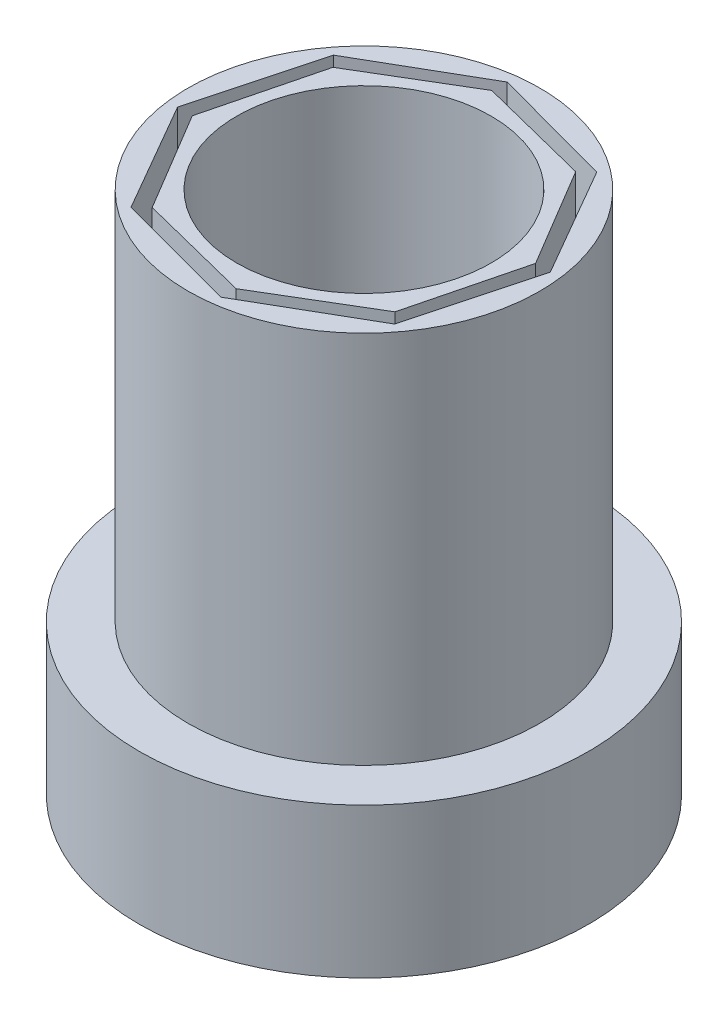
ISO-10303-21;
HEADER;
FILE_DESCRIPTION(('STEP AP214'),'2;1');
FILE_NAME('part.step','',(''),(''),'','','');
FILE_SCHEMA(('AUTOMOTIVE_DESIGN { 1 0 10303 214 1 1 1 1 }'));
ENDSEC;
DATA;
#1=APPLICATION_CONTEXT('core data for automotive mechanical design processes');
#2=APPLICATION_PROTOCOL_DEFINITION('international standard','automotive_design',2000,#1);
#3=PRODUCT_CONTEXT('',#1,'mechanical');
#4=PRODUCT('Part','Part','',(#3));
#5=PRODUCT_RELATED_PRODUCT_CATEGORY('part','',(#4));
#6=PRODUCT_DEFINITION_FORMATION('','',#4);
#7=PRODUCT_DEFINITION_CONTEXT('part definition',#1,'design');
#8=PRODUCT_DEFINITION('design','',#6,#7);
#9=PRODUCT_DEFINITION_SHAPE('','',#8);
#10=(LENGTH_UNIT() NAMED_UNIT(*) SI_UNIT(.MILLI.,.METRE.));
#11=(NAMED_UNIT(*) PLANE_ANGLE_UNIT() SI_UNIT($,.RADIAN.));
#12=(NAMED_UNIT(*) SI_UNIT($,.STERADIAN.) SOLID_ANGLE_UNIT());
#13=UNCERTAINTY_MEASURE_WITH_UNIT(LENGTH_MEASURE(1.E-05),#10,'distance_accuracy_value','');
#14=(GEOMETRIC_REPRESENTATION_CONTEXT(3) GLOBAL_UNCERTAINTY_ASSIGNED_CONTEXT((#13)) GLOBAL_UNIT_ASSIGNED_CONTEXT((#10,
#11,#12)) REPRESENTATION_CONTEXT('',''));
#15=CARTESIAN_POINT('',(0.,0.,0.));
#16=DIRECTION('',(0.,0.,1.));
#17=DIRECTION('',(1.,0.,0.));
#18=AXIS2_PLACEMENT_3D('',#15,#16,#17);
#19=CARTESIAN_POINT('',(0.,50.,0.));
#20=DIRECTION('',(0.,1.,0.));
#21=DIRECTION('',(0.,0.,1.));
#22=AXIS2_PLACEMENT_3D('',#19,#20,#21);
#23=PLANE('',#22);
#24=DIRECTION('',(0.858677824366591,0.,-0.512515749944388));
#25=VECTOR('',#24,1.);
#26=CARTESIAN_POINT('',(2.92893218813454,50.,20.));
#27=LINE('',#26,#25);
#28=CARTESIAN_POINT('',(2.92893218813454,50.,20.));
#29=VERTEX_POINT('',#28);
#30=CARTESIAN_POINT('',(16.2132034355964,50.,12.0710678118654));
#31=VERTEX_POINT('',#30);
#32=EDGE_CURVE('E266',#29,#31,#27,.T.);
#33=ORIENTED_EDGE('',*,*,#32,.T.);
#34=DIRECTION('',(0.244773550213542,0.,-0.969580274714713));
#35=VECTOR('',#34,1.);
#36=CARTESIAN_POINT('',(16.2132034355964,50.,12.0710678118654));
#37=LINE('',#36,#35);
#38=CARTESIAN_POINT('',(20.,50.,-2.92893218813454));
#39=VERTEX_POINT('',#38);
#40=EDGE_CURVE('E270',#31,#39,#37,.T.);
#41=ORIENTED_EDGE('',*,*,#40,.T.);
#42=DIRECTION('',(-0.512515749944388,0.,-0.858677824366591));
#43=VECTOR('',#42,1.);
#44=CARTESIAN_POINT('',(20.,50.,-2.92893218813454));
#45=LINE('',#44,#43);
#46=CARTESIAN_POINT('',(12.0710678118655,50.,-16.2132034355964));
#47=VERTEX_POINT('',#46);
#48=EDGE_CURVE('E274',#39,#47,#45,.T.);
#49=ORIENTED_EDGE('',*,*,#48,.T.);
#50=DIRECTION('',(-0.969580274714713,0.,-0.244773550213542));
#51=VECTOR('',#50,1.);
#52=CARTESIAN_POINT('',(12.0710678118655,50.,-16.2132034355964));
#53=LINE('',#52,#51);
#54=CARTESIAN_POINT('',(-2.92893218813455,50.,-20.));
#55=VERTEX_POINT('',#54);
#56=EDGE_CURVE('E277',#47,#55,#53,.T.);
#57=ORIENTED_EDGE('',*,*,#56,.T.);
#58=DIRECTION('',(-0.858677824366591,0.,0.512515749944388));
#59=VECTOR('',#58,1.);
#60=CARTESIAN_POINT('',(-2.92893218813455,50.,-20.));
#61=LINE('',#60,#59);
#62=CARTESIAN_POINT('',(-16.2132034355964,50.,-12.0710678118654));
#63=VERTEX_POINT('',#62);
#64=EDGE_CURVE('E280',#55,#63,#61,.T.);
#65=ORIENTED_EDGE('',*,*,#64,.T.);
#66=DIRECTION('',(-0.244773550213542,0.,0.969580274714713));
#67=VECTOR('',#66,1.);
#68=CARTESIAN_POINT('',(-16.2132034355964,50.,-12.0710678118654));
#69=LINE('',#68,#67);
#70=CARTESIAN_POINT('',(-20.,50.,2.92893218813455));
#71=VERTEX_POINT('',#70);
#72=EDGE_CURVE('E283',#63,#71,#69,.T.);
#73=ORIENTED_EDGE('',*,*,#72,.T.);
#74=DIRECTION('',(0.512515749944388,0.,0.858677824366591));
#75=VECTOR('',#74,1.);
#76=CARTESIAN_POINT('',(-20.,50.,2.92893218813455));
#77=LINE('',#76,#75);
#78=CARTESIAN_POINT('',(-12.0710678118655,50.,16.2132034355964));
#79=VERTEX_POINT('',#78);
#80=EDGE_CURVE('E286',#71,#79,#77,.T.);
#81=ORIENTED_EDGE('',*,*,#80,.T.);
#82=DIRECTION('',(0.969580274714713,0.,0.244773550213542));
#83=VECTOR('',#82,1.);
#84=CARTESIAN_POINT('',(-12.0710678118655,50.,16.2132034355964));
#85=LINE('',#84,#83);
#86=EDGE_CURVE('E289',#79,#29,#85,.T.);
#87=ORIENTED_EDGE('',*,*,#86,.T.);
#88=EDGE_LOOP('',(#33,#41,#49,#57,#65,#73,#81,#87));
#89=FACE_BOUND('',#88,.T.);
#90=CARTESIAN_POINT('',(0.,50.,0.));
#91=DIRECTION('',(0.,1.,0.));
#92=DIRECTION('',(0.,0.,1.));
#93=AXIS2_PLACEMENT_3D('',#90,#91,#92);
#94=CIRCLE('',#93,17.);
#95=CARTESIAN_POINT('',(0.,50.,17.));
#96=VERTEX_POINT('',#95);
#97=EDGE_CURVE('E258',#96,#96,#94,.T.);
#98=ORIENTED_EDGE('',*,*,#97,.F.);
#99=EDGE_LOOP('',(#98));
#100=FACE_BOUND('',#99,.T.);
#101=ADVANCED_FACE('F39',(#89,#100),#23,.T.);
#102=CARTESIAN_POINT('',(2.92893218813454,50.,20.));
#103=DIRECTION('',(-0.512515749944388,0.,-0.858677824366591));
#104=DIRECTION('',(-0.858677824366591,0.,0.512515749944388));
#105=AXIS2_PLACEMENT_3D('',#102,#103,#104);
#106=PLANE('',#105);
#107=DIRECTION('',(0.858677824366591,0.,-0.512515749944388));
#108=VECTOR('',#107,1.);
#109=CARTESIAN_POINT('',(2.92893218813454,0.,20.));
#110=LINE('',#109,#108);
#111=CARTESIAN_POINT('',(2.92893218813454,0.,20.));
#112=VERTEX_POINT('',#111);
#113=CARTESIAN_POINT('',(16.2132034355964,0.,12.0710678118654));
#114=VERTEX_POINT('',#113);
#115=EDGE_CURVE('E262',#112,#114,#110,.T.);
#116=ORIENTED_EDGE('',*,*,#115,.T.);
#117=DIRECTION('',(0.,-1.,0.));
#118=VECTOR('',#117,1.);
#119=CARTESIAN_POINT('',(16.2132034355964,50.,12.0710678118654));
#120=LINE('',#119,#118);
#121=EDGE_CURVE('E11',#31,#114,#120,.T.);
#122=ORIENTED_EDGE('',*,*,#121,.F.);
#123=ORIENTED_EDGE('',*,*,#32,.F.);
#124=DIRECTION('',(0.,-1.,0.));
#125=VECTOR('',#124,1.);
#126=CARTESIAN_POINT('',(2.92893218813454,50.,20.));
#127=LINE('',#126,#125);
#128=EDGE_CURVE('E292',#29,#112,#127,.T.);
#129=ORIENTED_EDGE('',*,*,#128,.T.);
#130=EDGE_LOOP('',(#116,#122,#123,#129));
#131=FACE_BOUND('',#130,.T.);
#132=ADVANCED_FACE('F41',(#131),#106,.F.);
#133=CARTESIAN_POINT('',(16.2132034355964,50.,12.0710678118654));
#134=DIRECTION('',(-0.969580274714713,0.,-0.244773550213542));
#135=DIRECTION('',(-0.244773550213542,0.,0.969580274714713));
#136=AXIS2_PLACEMENT_3D('',#133,#134,#135);
#137=PLANE('',#136);
#138=DIRECTION('',(0.244773550213542,0.,-0.969580274714713));
#139=VECTOR('',#138,1.);
#140=CARTESIAN_POINT('',(16.2132034355964,0.,12.0710678118654));
#141=LINE('',#140,#139);
#142=CARTESIAN_POINT('',(20.,0.,-2.92893218813454));
#143=VERTEX_POINT('',#142);
#144=EDGE_CURVE('E296',#114,#143,#141,.T.);
#145=ORIENTED_EDGE('',*,*,#144,.T.);
#146=DIRECTION('',(0.,-1.,0.));
#147=VECTOR('',#146,1.);
#148=CARTESIAN_POINT('',(20.,50.,-2.92893218813454));
#149=LINE('',#148,#147);
#150=EDGE_CURVE('E48',#39,#143,#149,.T.);
#151=ORIENTED_EDGE('',*,*,#150,.F.);
#152=ORIENTED_EDGE('',*,*,#40,.F.);
#153=ORIENTED_EDGE('',*,*,#121,.T.);
#154=EDGE_LOOP('',(#145,#151,#152,#153));
#155=FACE_BOUND('',#154,.T.);
#156=ADVANCED_FACE('F353',(#155),#137,.F.);
#157=CARTESIAN_POINT('',(20.,50.,-2.92893218813454));
#158=DIRECTION('',(-0.858677824366591,0.,0.512515749944388));
#159=DIRECTION('',(0.512515749944388,0.,0.858677824366591));
#160=AXIS2_PLACEMENT_3D('',#157,#158,#159);
#161=PLANE('',#160);
#162=DIRECTION('',(-0.512515749944388,0.,-0.858677824366591));
#163=VECTOR('',#162,1.);
#164=CARTESIAN_POINT('',(20.,0.,-2.92893218813454));
#165=LINE('',#164,#163);
#166=CARTESIAN_POINT('',(12.0710678118655,0.,-16.2132034355964));
#167=VERTEX_POINT('',#166);
#168=EDGE_CURVE('E300',#143,#167,#165,.T.);
#169=ORIENTED_EDGE('',*,*,#168,.T.);
#170=DIRECTION('',(0.,-1.,0.));
#171=VECTOR('',#170,1.);
#172=CARTESIAN_POINT('',(12.0710678118655,50.,-16.2132034355964));
#173=LINE('',#172,#171);
#174=EDGE_CURVE('E342',#47,#167,#173,.T.);
#175=ORIENTED_EDGE('',*,*,#174,.F.);
#176=ORIENTED_EDGE('',*,*,#48,.F.);
#177=ORIENTED_EDGE('',*,*,#150,.T.);
#178=EDGE_LOOP('',(#169,#175,#176,#177));
#179=FACE_BOUND('',#178,.T.);
#180=ADVANCED_FACE('F350',(#179),#161,.F.);
#181=CARTESIAN_POINT('',(12.0710678118655,50.,-16.2132034355964));
#182=DIRECTION('',(-0.244773550213542,0.,0.969580274714713));
#183=DIRECTION('',(0.969580274714713,0.,0.244773550213542));
#184=AXIS2_PLACEMENT_3D('',#181,#182,#183);
#185=PLANE('',#184);
#186=DIRECTION('',(-0.969580274714713,0.,-0.244773550213542));
#187=VECTOR('',#186,1.);
#188=CARTESIAN_POINT('',(12.0710678118655,0.,-16.2132034355964));
#189=LINE('',#188,#187);
#190=CARTESIAN_POINT('',(-2.92893218813455,0.,-20.));
#191=VERTEX_POINT('',#190);
#192=EDGE_CURVE('E304',#167,#191,#189,.T.);
#193=ORIENTED_EDGE('',*,*,#192,.T.);
#194=DIRECTION('',(0.,-1.,0.));
#195=VECTOR('',#194,1.);
#196=CARTESIAN_POINT('',(-2.92893218813455,50.,-20.));
#197=LINE('',#196,#195);
#198=EDGE_CURVE('E338',#55,#191,#197,.T.);
#199=ORIENTED_EDGE('',*,*,#198,.F.);
#200=ORIENTED_EDGE('',*,*,#56,.F.);
#201=ORIENTED_EDGE('',*,*,#174,.T.);
#202=EDGE_LOOP('',(#193,#199,#200,#201));
#203=FACE_BOUND('',#202,.T.);
#204=ADVANCED_FACE('F359',(#203),#185,.F.);
#205=CARTESIAN_POINT('',(-2.92893218813455,50.,-20.));
#206=DIRECTION('',(0.512515749944388,0.,0.858677824366591));
#207=DIRECTION('',(0.858677824366591,0.,-0.512515749944388));
#208=AXIS2_PLACEMENT_3D('',#205,#206,#207);
#209=PLANE('',#208);
#210=DIRECTION('',(-0.858677824366591,0.,0.512515749944388));
#211=VECTOR('',#210,1.);
#212=CARTESIAN_POINT('',(-2.92893218813455,0.,-20.));
#213=LINE('',#212,#211);
#214=CARTESIAN_POINT('',(-16.2132034355964,0.,-12.0710678118654));
#215=VERTEX_POINT('',#214);
#216=EDGE_CURVE('E308',#191,#215,#213,.T.);
#217=ORIENTED_EDGE('',*,*,#216,.T.);
#218=DIRECTION('',(0.,-1.,0.));
#219=VECTOR('',#218,1.);
#220=CARTESIAN_POINT('',(-16.2132034355964,50.,-12.0710678118654));
#221=LINE('',#220,#219);
#222=EDGE_CURVE('E334',#63,#215,#221,.T.);
#223=ORIENTED_EDGE('',*,*,#222,.F.);
#224=ORIENTED_EDGE('',*,*,#64,.F.);
#225=ORIENTED_EDGE('',*,*,#198,.T.);
#226=EDGE_LOOP('',(#217,#223,#224,#225));
#227=FACE_BOUND('',#226,.T.);
#228=ADVANCED_FACE('F363',(#227),#209,.F.);
#229=CARTESIAN_POINT('',(-16.2132034355964,50.,-12.0710678118654));
#230=DIRECTION('',(0.969580274714713,0.,0.244773550213542));
#231=DIRECTION('',(0.244773550213542,0.,-0.969580274714713));
#232=AXIS2_PLACEMENT_3D('',#229,#230,#231);
#233=PLANE('',#232);
#234=DIRECTION('',(-0.244773550213542,0.,0.969580274714713));
#235=VECTOR('',#234,1.);
#236=CARTESIAN_POINT('',(-16.2132034355964,0.,-12.0710678118654));
#237=LINE('',#236,#235);
#238=CARTESIAN_POINT('',(-20.,0.,2.92893218813455));
#239=VERTEX_POINT('',#238);
#240=EDGE_CURVE('E312',#215,#239,#237,.T.);
#241=ORIENTED_EDGE('',*,*,#240,.T.);
#242=DIRECTION('',(0.,-1.,0.));
#243=VECTOR('',#242,1.);
#244=CARTESIAN_POINT('',(-20.,50.,2.92893218813455));
#245=LINE('',#244,#243);
#246=EDGE_CURVE('E330',#71,#239,#245,.T.);
#247=ORIENTED_EDGE('',*,*,#246,.F.);
#248=ORIENTED_EDGE('',*,*,#72,.F.);
#249=ORIENTED_EDGE('',*,*,#222,.T.);
#250=EDGE_LOOP('',(#241,#247,#248,#249));
#251=FACE_BOUND('',#250,.T.);
#252=ADVANCED_FACE('F380',(#251),#233,.F.);
#253=CARTESIAN_POINT('',(-20.,50.,2.92893218813455));
#254=DIRECTION('',(0.858677824366591,0.,-0.512515749944388));
#255=DIRECTION('',(-0.512515749944388,0.,-0.858677824366591));
#256=AXIS2_PLACEMENT_3D('',#253,#254,#255);
#257=PLANE('',#256);
#258=DIRECTION('',(0.512515749944388,0.,0.858677824366591));
#259=VECTOR('',#258,1.);
#260=CARTESIAN_POINT('',(-20.,0.,2.92893218813455));
#261=LINE('',#260,#259);
#262=CARTESIAN_POINT('',(-12.0710678118655,0.,16.2132034355964));
#263=VERTEX_POINT('',#262);
#264=EDGE_CURVE('E316',#239,#263,#261,.T.);
#265=ORIENTED_EDGE('',*,*,#264,.T.);
#266=DIRECTION('',(0.,-1.,0.));
#267=VECTOR('',#266,1.);
#268=CARTESIAN_POINT('',(-12.0710678118655,50.,16.2132034355964));
#269=LINE('',#268,#267);
#270=EDGE_CURVE('E326',#79,#263,#269,.T.);
#271=ORIENTED_EDGE('',*,*,#270,.F.);
#272=ORIENTED_EDGE('',*,*,#80,.F.);
#273=ORIENTED_EDGE('',*,*,#246,.T.);
#274=EDGE_LOOP('',(#265,#271,#272,#273));
#275=FACE_BOUND('',#274,.T.);
#276=ADVANCED_FACE('F377',(#275),#257,.F.);
#277=CARTESIAN_POINT('',(-12.0710678118655,50.,16.2132034355964));
#278=DIRECTION('',(0.244773550213542,0.,-0.969580274714713));
#279=DIRECTION('',(-0.969580274714713,0.,-0.244773550213542));
#280=AXIS2_PLACEMENT_3D('',#277,#278,#279);
#281=PLANE('',#280);
#282=DIRECTION('',(0.969580274714713,0.,0.244773550213542));
#283=VECTOR('',#282,1.);
#284=CARTESIAN_POINT('',(-12.0710678118655,0.,16.2132034355964));
#285=LINE('',#284,#283);
#286=EDGE_CURVE('E271',#263,#112,#285,.T.);
#287=ORIENTED_EDGE('',*,*,#286,.T.);
#288=ORIENTED_EDGE('',*,*,#128,.F.);
#289=ORIENTED_EDGE('',*,*,#86,.F.);
#290=ORIENTED_EDGE('',*,*,#270,.T.);
#291=EDGE_LOOP('',(#287,#288,#289,#290));
#292=FACE_BOUND('',#291,.T.);
#293=ADVANCED_FACE('F374',(#292),#281,.F.);
#294=CARTESIAN_POINT('',(0.,50.,0.));
#295=DIRECTION('',(0.,-1.,0.));
#296=DIRECTION('',(0.,0.,-1.));
#297=AXIS2_PLACEMENT_3D('',#294,#295,#296);
#298=CYLINDRICAL_SURFACE('',#297,17.);
#299=ORIENTED_EDGE('',*,*,#97,.T.);
#300=EDGE_LOOP('',(#299));
#301=FACE_BOUND('',#300,.T.);
#302=CARTESIAN_POINT('',(0.,0.,0.));
#303=DIRECTION('',(0.,1.,0.));
#304=DIRECTION('',(0.,0.,1.));
#305=AXIS2_PLACEMENT_3D('',#302,#303,#304);
#306=CIRCLE('',#305,17.);
#307=CARTESIAN_POINT('',(0.,0.,17.));
#308=VERTEX_POINT('',#307);
#309=EDGE_CURVE('E254',#308,#308,#306,.T.);
#310=ORIENTED_EDGE('',*,*,#309,.F.);
#311=EDGE_LOOP('',(#310));
#312=FACE_BOUND('',#311,.T.);
#313=ADVANCED_FACE('F396',(#301,#312),#298,.F.);
#314=CARTESIAN_POINT('',(0.,0.,0.));
#315=DIRECTION('',(0.,1.,0.));
#316=DIRECTION('',(0.,0.,1.));
#317=AXIS2_PLACEMENT_3D('',#314,#315,#316);
#318=PLANE('',#317);
#319=ORIENTED_EDGE('',*,*,#309,.T.);
#320=EDGE_LOOP('',(#319));
#321=FACE_BOUND('',#320,.T.);
#322=ADVANCED_FACE('F402',(#321),#318,.T.);
#323=DIRECTION('',(-0.965855101196709,0.,-0.259082850633334));
#324=VECTOR('',#323,1.);
#325=CARTESIAN_POINT('',(13.5126392231431,0.,-17.600059149065));
#326=LINE('',#325,#324);
#327=CARTESIAN_POINT('',(13.5126392231431,0.,-17.600059149065));
#328=VERTEX_POINT('',#327);
#329=CARTESIAN_POINT('',(-2.8902423471764,0.,-22.));
#330=VERTEX_POINT('',#329);
#331=EDGE_CURVE('E55',#328,#330,#326,.T.);
#332=ORIENTED_EDGE('',*,*,#331,.T.);
#333=DIRECTION('',(-0.866161932271784,0.,0.49976345112784));
#334=VECTOR('',#333,1.);
#335=CARTESIAN_POINT('',(-2.8902423471764,0.,-22.));
#336=LINE('',#335,#334);
#337=CARTESIAN_POINT('',(-17.600059149065,0.,-13.5126392231431));
#338=VERTEX_POINT('',#337);
#339=EDGE_CURVE('E59',#330,#338,#336,.T.);
#340=ORIENTED_EDGE('',*,*,#339,.T.);
#341=DIRECTION('',(-0.259082850633334,0.,0.965855101196709));
#342=VECTOR('',#341,1.);
#343=CARTESIAN_POINT('',(-17.600059149065,0.,-13.5126392231431));
#344=LINE('',#343,#342);
#345=CARTESIAN_POINT('',(-22.,0.,2.89024234717641));
#346=VERTEX_POINT('',#345);
#347=EDGE_CURVE('E201',#338,#346,#344,.T.);
#348=ORIENTED_EDGE('',*,*,#347,.T.);
#349=DIRECTION('',(0.49976345112784,0.,0.866161932271784));
#350=VECTOR('',#349,1.);
#351=CARTESIAN_POINT('',(-22.,0.,2.89024234717641));
#352=LINE('',#351,#350);
#353=CARTESIAN_POINT('',(-13.5126392231431,0.,17.600059149065));
#354=VERTEX_POINT('',#353);
#355=EDGE_CURVE('E204',#346,#354,#352,.T.);
#356=ORIENTED_EDGE('',*,*,#355,.T.);
#357=DIRECTION('',(0.965855101196709,0.,0.259082850633334));
#358=VECTOR('',#357,1.);
#359=CARTESIAN_POINT('',(-13.5126392231431,0.,17.600059149065));
#360=LINE('',#359,#358);
#361=CARTESIAN_POINT('',(2.89024234717641,0.,22.));
#362=VERTEX_POINT('',#361);
#363=EDGE_CURVE('E207',#354,#362,#360,.T.);
#364=ORIENTED_EDGE('',*,*,#363,.T.);
#365=DIRECTION('',(0.866161932271784,0.,-0.49976345112784));
#366=VECTOR('',#365,1.);
#367=CARTESIAN_POINT('',(2.89024234717641,0.,22.));
#368=LINE('',#367,#366);
#369=CARTESIAN_POINT('',(17.600059149065,0.,13.5126392231431));
#370=VERTEX_POINT('',#369);
#371=EDGE_CURVE('E210',#362,#370,#368,.T.);
#372=ORIENTED_EDGE('',*,*,#371,.T.);
#373=DIRECTION('',(0.259082850633334,0.,-0.965855101196709));
#374=VECTOR('',#373,1.);
#375=CARTESIAN_POINT('',(17.600059149065,0.,13.5126392231431));
#376=LINE('',#375,#374);
#377=CARTESIAN_POINT('',(22.,0.,-2.89024234717642));
#378=VERTEX_POINT('',#377);
#379=EDGE_CURVE('E213',#370,#378,#376,.T.);
#380=ORIENTED_EDGE('',*,*,#379,.T.);
#381=DIRECTION('',(-0.49976345112784,0.,-0.866161932271784));
#382=VECTOR('',#381,1.);
#383=CARTESIAN_POINT('',(22.,0.,-2.89024234717642));
#384=LINE('',#383,#382);
#385=EDGE_CURVE('E163',#378,#328,#384,.T.);
#386=ORIENTED_EDGE('',*,*,#385,.T.);
#387=EDGE_LOOP('',(#332,#340,#348,#356,#364,#372,#380,#386));
#388=FACE_BOUND('',#387,.T.);
#389=ORIENTED_EDGE('',*,*,#115,.F.);
#390=ORIENTED_EDGE('',*,*,#286,.F.);
#391=ORIENTED_EDGE('',*,*,#264,.F.);
#392=ORIENTED_EDGE('',*,*,#240,.F.);
#393=ORIENTED_EDGE('',*,*,#216,.F.);
#394=ORIENTED_EDGE('',*,*,#192,.F.);
#395=ORIENTED_EDGE('',*,*,#168,.F.);
#396=ORIENTED_EDGE('',*,*,#144,.F.);
#397=EDGE_LOOP('',(#389,#390,#391,#392,#393,#394,#395,#396));
#398=FACE_BOUND('',#397,.T.);
#399=ADVANCED_FACE('F356',(#388,#398),#318,.T.);
#400=CARTESIAN_POINT('',(0.,50.,0.));
#401=DIRECTION('',(0.,1.,0.));
#402=DIRECTION('',(0.,0.,1.));
#403=AXIS2_PLACEMENT_3D('',#400,#401,#402);
#404=PLANE('',#403);
#405=CARTESIAN_POINT('',(0.,50.,0.));
#406=DIRECTION('',(0.,1.,0.));
#407=DIRECTION('',(0.,0.,1.));
#408=AXIS2_PLACEMENT_3D('',#405,#406,#407);
#409=CIRCLE('',#408,23.5);
#410=CARTESIAN_POINT('',(0.,50.,23.5));
#411=VERTEX_POINT('',#410);
#412=EDGE_CURVE('E242',#411,#411,#409,.T.);
#413=ORIENTED_EDGE('',*,*,#412,.T.);
#414=EDGE_LOOP('',(#413));
#415=FACE_BOUND('',#414,.T.);
#416=DIRECTION('',(-0.866161932271784,0.,0.49976345112784));
#417=VECTOR('',#416,1.);
#418=CARTESIAN_POINT('',(-2.8902423471764,50.,-22.));
#419=LINE('',#418,#417);
#420=CARTESIAN_POINT('',(-2.8902423471764,50.,-22.));
#421=VERTEX_POINT('',#420);
#422=CARTESIAN_POINT('',(-17.600059149065,50.,-13.5126392231431));
#423=VERTEX_POINT('',#422);
#424=EDGE_CURVE('E162',#421,#423,#419,.T.);
#425=ORIENTED_EDGE('',*,*,#424,.F.);
#426=DIRECTION('',(-0.965855101196709,0.,-0.259082850633334));
#427=VECTOR('',#426,1.);
#428=CARTESIAN_POINT('',(13.5126392231431,50.,-17.600059149065));
#429=LINE('',#428,#427);
#430=CARTESIAN_POINT('',(13.5126392231431,50.,-17.600059149065));
#431=VERTEX_POINT('',#430);
#432=EDGE_CURVE('E152',#431,#421,#429,.T.);
#433=ORIENTED_EDGE('',*,*,#432,.F.);
#434=DIRECTION('',(-0.49976345112784,0.,-0.866161932271784));
#435=VECTOR('',#434,1.);
#436=CARTESIAN_POINT('',(22.,50.,-2.89024234717642));
#437=LINE('',#436,#435);
#438=CARTESIAN_POINT('',(22.,50.,-2.89024234717641));
#439=VERTEX_POINT('',#438);
#440=EDGE_CURVE('E194',#439,#431,#437,.T.);
#441=ORIENTED_EDGE('',*,*,#440,.F.);
#442=DIRECTION('',(0.259082850633334,0.,-0.965855101196709));
#443=VECTOR('',#442,1.);
#444=CARTESIAN_POINT('',(17.600059149065,50.,13.5126392231431));
#445=LINE('',#444,#443);
#446=CARTESIAN_POINT('',(17.600059149065,50.,13.5126392231431));
#447=VERTEX_POINT('',#446);
#448=EDGE_CURVE('E190',#447,#439,#445,.T.);
#449=ORIENTED_EDGE('',*,*,#448,.F.);
#450=DIRECTION('',(0.866161932271784,0.,-0.49976345112784));
#451=VECTOR('',#450,1.);
#452=CARTESIAN_POINT('',(2.89024234717641,50.,22.));
#453=LINE('',#452,#451);
#454=CARTESIAN_POINT('',(2.89024234717641,50.,22.));
#455=VERTEX_POINT('',#454);
#456=EDGE_CURVE('E187',#455,#447,#453,.T.);
#457=ORIENTED_EDGE('',*,*,#456,.F.);
#458=DIRECTION('',(0.965855101196709,0.,0.259082850633334));
#459=VECTOR('',#458,1.);
#460=CARTESIAN_POINT('',(-13.5126392231431,50.,17.600059149065));
#461=LINE('',#460,#459);
#462=CARTESIAN_POINT('',(-13.5126392231431,50.,17.600059149065));
#463=VERTEX_POINT('',#462);
#464=EDGE_CURVE('E184',#463,#455,#461,.T.);
#465=ORIENTED_EDGE('',*,*,#464,.F.);
#466=DIRECTION('',(0.49976345112784,0.,0.866161932271784));
#467=VECTOR('',#466,1.);
#468=CARTESIAN_POINT('',(-22.,50.,2.89024234717641));
#469=LINE('',#468,#467);
#470=CARTESIAN_POINT('',(-22.,50.,2.89024234717641));
#471=VERTEX_POINT('',#470);
#472=EDGE_CURVE('E179',#471,#463,#469,.T.);
#473=ORIENTED_EDGE('',*,*,#472,.F.);
#474=DIRECTION('',(-0.259082850633334,0.,0.965855101196709));
#475=VECTOR('',#474,1.);
#476=CARTESIAN_POINT('',(-17.600059149065,50.,-13.5126392231431));
#477=LINE('',#476,#475);
#478=EDGE_CURVE('E175',#423,#471,#477,.T.);
#479=ORIENTED_EDGE('',*,*,#478,.F.);
#480=EDGE_LOOP('',(#425,#433,#441,#449,#457,#465,#473,#479));
#481=FACE_BOUND('',#480,.T.);
#482=ADVANCED_FACE('F173',(#415,#481),#404,.T.);
#483=CARTESIAN_POINT('',(0.,50.,0.));
#484=DIRECTION('',(0.,-1.,0.));
#485=DIRECTION('',(0.,0.,-1.));
#486=AXIS2_PLACEMENT_3D('',#483,#484,#485);
#487=CYLINDRICAL_SURFACE('',#486,23.5);
#488=ORIENTED_EDGE('',*,*,#412,.F.);
#489=EDGE_LOOP('',(#488));
#490=FACE_BOUND('',#489,.T.);
#491=CARTESIAN_POINT('',(0.,0.,0.));
#492=DIRECTION('',(0.,1.,0.));
#493=DIRECTION('',(0.,0.,1.));
#494=AXIS2_PLACEMENT_3D('',#491,#492,#493);
#495=CIRCLE('',#494,23.5);
#496=CARTESIAN_POINT('',(0.,0.,23.5));
#497=VERTEX_POINT('',#496);
#498=EDGE_CURVE('E169',#497,#497,#495,.T.);
#499=ORIENTED_EDGE('',*,*,#498,.T.);
#500=EDGE_LOOP('',(#499));
#501=FACE_BOUND('',#500,.T.);
#502=ADVANCED_FACE('F429',(#490,#501),#487,.T.);
#503=CARTESIAN_POINT('',(13.5126392231431,50.,-17.600059149065));
#504=DIRECTION('',(-0.259082850633334,0.,0.965855101196709));
#505=DIRECTION('',(0.965855101196709,0.,0.259082850633334));
#506=AXIS2_PLACEMENT_3D('',#503,#504,#505);
#507=PLANE('',#506);
#508=ORIENTED_EDGE('',*,*,#331,.F.);
#509=DIRECTION('',(0.,-1.,0.));
#510=VECTOR('',#509,1.);
#511=CARTESIAN_POINT('',(13.5126392231431,50.,-17.600059149065));
#512=LINE('',#511,#510);
#513=EDGE_CURVE('E157',#431,#328,#512,.T.);
#514=ORIENTED_EDGE('',*,*,#513,.F.);
#515=ORIENTED_EDGE('',*,*,#432,.T.);
#516=DIRECTION('',(0.,-1.,0.));
#517=VECTOR('',#516,1.);
#518=CARTESIAN_POINT('',(-2.8902423471764,50.,-22.));
#519=LINE('',#518,#517);
#520=EDGE_CURVE('E155',#421,#330,#519,.T.);
#521=ORIENTED_EDGE('',*,*,#520,.T.);
#522=EDGE_LOOP('',(#508,#514,#515,#521));
#523=FACE_BOUND('',#522,.T.);
#524=ADVANCED_FACE('F154',(#523),#507,.T.);
#525=CARTESIAN_POINT('',(-2.8902423471764,50.,-22.));
#526=DIRECTION('',(0.49976345112784,0.,0.866161932271784));
#527=DIRECTION('',(0.866161932271784,0.,-0.49976345112784));
#528=AXIS2_PLACEMENT_3D('',#525,#526,#527);
#529=PLANE('',#528);
#530=ORIENTED_EDGE('',*,*,#339,.F.);
#531=ORIENTED_EDGE('',*,*,#520,.F.);
#532=ORIENTED_EDGE('',*,*,#424,.T.);
#533=DIRECTION('',(0.,-1.,0.));
#534=VECTOR('',#533,1.);
#535=CARTESIAN_POINT('',(-17.600059149065,50.,-13.5126392231431));
#536=LINE('',#535,#534);
#537=EDGE_CURVE('E170',#423,#338,#536,.T.);
#538=ORIENTED_EDGE('',*,*,#537,.T.);
#539=EDGE_LOOP('',(#530,#531,#532,#538));
#540=FACE_BOUND('',#539,.T.);
#541=ADVANCED_FACE('F166',(#540),#529,.T.);
#542=CARTESIAN_POINT('',(-17.600059149065,50.,-13.5126392231431));
#543=DIRECTION('',(0.965855101196709,0.,0.259082850633334));
#544=DIRECTION('',(0.259082850633334,0.,-0.965855101196709));
#545=AXIS2_PLACEMENT_3D('',#542,#543,#544);
#546=PLANE('',#545);
#547=ORIENTED_EDGE('',*,*,#347,.F.);
#548=ORIENTED_EDGE('',*,*,#537,.F.);
#549=ORIENTED_EDGE('',*,*,#478,.T.);
#550=DIRECTION('',(0.,-1.,0.));
#551=VECTOR('',#550,1.);
#552=CARTESIAN_POINT('',(-22.,50.,2.89024234717641));
#553=LINE('',#552,#551);
#554=EDGE_CURVE('E236',#471,#346,#553,.T.);
#555=ORIENTED_EDGE('',*,*,#554,.T.);
#556=EDGE_LOOP('',(#547,#548,#549,#555));
#557=FACE_BOUND('',#556,.T.);
#558=ADVANCED_FACE('F470',(#557),#546,.T.);
#559=CARTESIAN_POINT('',(-22.,50.,2.89024234717641));
#560=DIRECTION('',(0.866161932271784,0.,-0.49976345112784));
#561=DIRECTION('',(-0.49976345112784,0.,-0.866161932271784));
#562=AXIS2_PLACEMENT_3D('',#559,#560,#561);
#563=PLANE('',#562);
#564=ORIENTED_EDGE('',*,*,#355,.F.);
#565=ORIENTED_EDGE('',*,*,#554,.F.);
#566=ORIENTED_EDGE('',*,*,#472,.T.);
#567=DIRECTION('',(0.,-1.,0.));
#568=VECTOR('',#567,1.);
#569=CARTESIAN_POINT('',(-13.5126392231431,50.,17.600059149065));
#570=LINE('',#569,#568);
#571=EDGE_CURVE('E232',#463,#354,#570,.T.);
#572=ORIENTED_EDGE('',*,*,#571,.T.);
#573=EDGE_LOOP('',(#564,#565,#566,#572));
#574=FACE_BOUND('',#573,.T.);
#575=ADVANCED_FACE('F466',(#574),#563,.T.);
#576=CARTESIAN_POINT('',(-13.5126392231431,50.,17.600059149065));
#577=DIRECTION('',(0.259082850633334,0.,-0.965855101196709));
#578=DIRECTION('',(-0.965855101196709,0.,-0.259082850633334));
#579=AXIS2_PLACEMENT_3D('',#576,#577,#578);
#580=PLANE('',#579);
#581=ORIENTED_EDGE('',*,*,#363,.F.);
#582=ORIENTED_EDGE('',*,*,#571,.F.);
#583=ORIENTED_EDGE('',*,*,#464,.T.);
#584=DIRECTION('',(0.,-1.,0.));
#585=VECTOR('',#584,1.);
#586=CARTESIAN_POINT('',(2.89024234717641,50.,22.));
#587=LINE('',#586,#585);
#588=EDGE_CURVE('E228',#455,#362,#587,.T.);
#589=ORIENTED_EDGE('',*,*,#588,.T.);
#590=EDGE_LOOP('',(#581,#582,#583,#589));
#591=FACE_BOUND('',#590,.T.);
#592=ADVANCED_FACE('F462',(#591),#580,.T.);
#593=CARTESIAN_POINT('',(2.89024234717641,50.,22.));
#594=DIRECTION('',(-0.49976345112784,0.,-0.866161932271784));
#595=DIRECTION('',(-0.866161932271784,0.,0.49976345112784));
#596=AXIS2_PLACEMENT_3D('',#593,#594,#595);
#597=PLANE('',#596);
#598=ORIENTED_EDGE('',*,*,#371,.F.);
#599=ORIENTED_EDGE('',*,*,#588,.F.);
#600=ORIENTED_EDGE('',*,*,#456,.T.);
#601=DIRECTION('',(0.,-1.,0.));
#602=VECTOR('',#601,1.);
#603=CARTESIAN_POINT('',(17.600059149065,50.,13.5126392231431));
#604=LINE('',#603,#602);
#605=EDGE_CURVE('E224',#447,#370,#604,.T.);
#606=ORIENTED_EDGE('',*,*,#605,.T.);
#607=EDGE_LOOP('',(#598,#599,#600,#606));
#608=FACE_BOUND('',#607,.T.);
#609=ADVANCED_FACE('F455',(#608),#597,.T.);
#610=CARTESIAN_POINT('',(17.600059149065,50.,13.5126392231431));
#611=DIRECTION('',(-0.965855101196709,0.,-0.259082850633334));
#612=DIRECTION('',(-0.259082850633334,0.,0.965855101196709));
#613=AXIS2_PLACEMENT_3D('',#610,#611,#612);
#614=PLANE('',#613);
#615=ORIENTED_EDGE('',*,*,#379,.F.);
#616=ORIENTED_EDGE('',*,*,#605,.F.);
#617=ORIENTED_EDGE('',*,*,#448,.T.);
#618=DIRECTION('',(0.,-1.,0.));
#619=VECTOR('',#618,1.);
#620=CARTESIAN_POINT('',(22.,50.,-2.89024234717642));
#621=LINE('',#620,#619);
#622=EDGE_CURVE('E220',#439,#378,#621,.T.);
#623=ORIENTED_EDGE('',*,*,#622,.T.);
#624=EDGE_LOOP('',(#615,#616,#617,#623));
#625=FACE_BOUND('',#624,.T.);
#626=ADVANCED_FACE('F447',(#625),#614,.T.);
#627=CARTESIAN_POINT('',(22.,50.,-2.89024234717642));
#628=DIRECTION('',(-0.866161932271784,0.,0.49976345112784));
#629=DIRECTION('',(0.49976345112784,0.,0.866161932271784));
#630=AXIS2_PLACEMENT_3D('',#627,#628,#629);
#631=PLANE('',#630);
#632=ORIENTED_EDGE('',*,*,#385,.F.);
#633=ORIENTED_EDGE('',*,*,#622,.F.);
#634=ORIENTED_EDGE('',*,*,#440,.T.);
#635=ORIENTED_EDGE('',*,*,#513,.T.);
#636=EDGE_LOOP('',(#632,#633,#634,#635));
#637=FACE_BOUND('',#636,.T.);
#638=ADVANCED_FACE('F442',(#637),#631,.T.);
#639=CARTESIAN_POINT('',(0.,-20.,0.));
#640=DIRECTION('',(0.,1.,0.));
#641=DIRECTION('',(0.,0.,1.));
#642=AXIS2_PLACEMENT_3D('',#639,#640,#641);
#643=PLANE('',#642);
#644=CARTESIAN_POINT('',(0.,-20.,0.));
#645=DIRECTION('',(0.,1.,0.));
#646=DIRECTION('',(0.,0.,1.));
#647=AXIS2_PLACEMENT_3D('',#644,#645,#646);
#648=CIRCLE('',#647,30.);
#649=CARTESIAN_POINT('',(0.,-20.,30.));
#650=VERTEX_POINT('',#649);
#651=EDGE_CURVE('E250',#650,#650,#648,.T.);
#652=ORIENTED_EDGE('',*,*,#651,.F.);
#653=EDGE_LOOP('',(#652));
#654=FACE_BOUND('',#653,.T.);
#655=ADVANCED_FACE('F423',(#654),#643,.F.);
#656=CARTESIAN_POINT('',(0.,-20.,0.));
#657=DIRECTION('',(0.,1.,0.));
#658=DIRECTION('',(0.,0.,1.));
#659=AXIS2_PLACEMENT_3D('',#656,#657,#658);
#660=CYLINDRICAL_SURFACE('',#659,30.);
#661=ORIENTED_EDGE('',*,*,#651,.T.);
#662=EDGE_LOOP('',(#661));
#663=FACE_BOUND('',#662,.T.);
#664=CARTESIAN_POINT('',(0.,0.,0.));
#665=DIRECTION('',(0.,1.,0.));
#666=DIRECTION('',(0.,0.,1.));
#667=AXIS2_PLACEMENT_3D('',#664,#665,#666);
#668=CIRCLE('',#667,30.);
#669=CARTESIAN_POINT('',(0.,0.,30.));
#670=VERTEX_POINT('',#669);
#671=EDGE_CURVE('E246',#670,#670,#668,.T.);
#672=ORIENTED_EDGE('',*,*,#671,.F.);
#673=EDGE_LOOP('',(#672));
#674=FACE_BOUND('',#673,.T.);
#675=ADVANCED_FACE('F418',(#663,#674),#660,.T.);
#676=ORIENTED_EDGE('',*,*,#671,.T.);
#677=EDGE_LOOP('',(#676));
#678=FACE_BOUND('',#677,.T.);
#679=ORIENTED_EDGE('',*,*,#498,.F.);
#680=EDGE_LOOP('',(#679));
#681=FACE_BOUND('',#680,.T.);
#682=ADVANCED_FACE('F409',(#678,#681),#318,.T.);
#683=CLOSED_SHELL('',(#101,#132,#156,#180,#204,#228,#252,#276,#293,#313,#322,#399,#482,#502,
#524,#541,#558,#575,#592,#609,#626,#638,#655,#675,#682));
#684=MANIFOLD_SOLID_BREP('B2',#683);
#685=ADVANCED_BREP_SHAPE_REPRESENTATION('',(#18,#684),#14);
#686=SHAPE_DEFINITION_REPRESENTATION(#9,#685);
ENDSEC;
END-ISO-10303-21;
